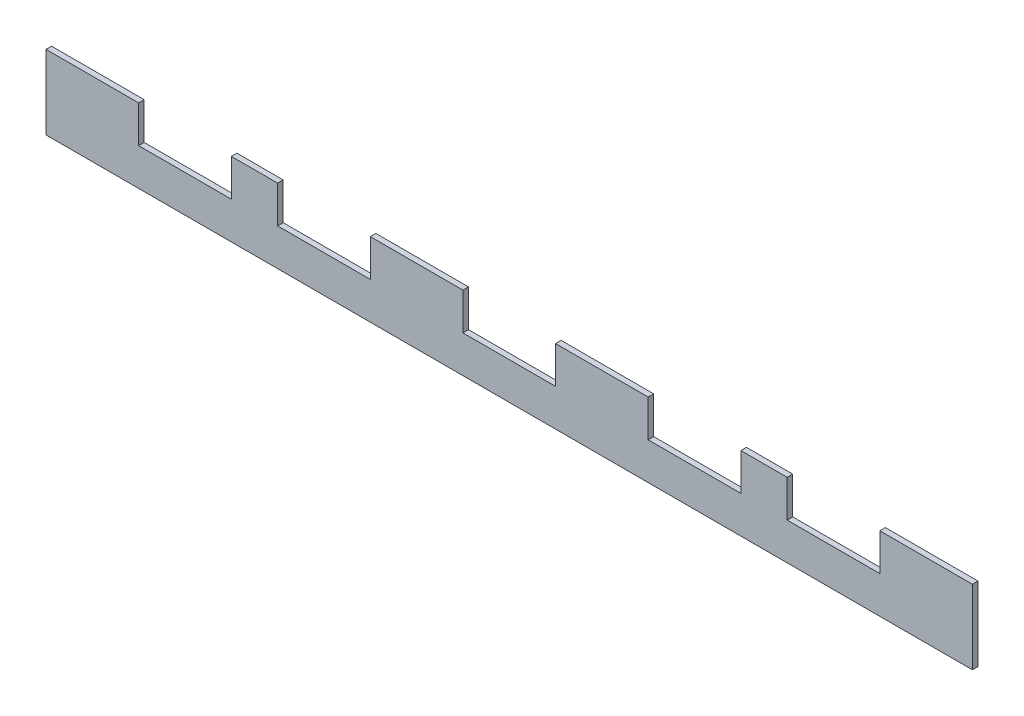
ISO-10303-21;
HEADER;
FILE_DESCRIPTION(('STEP AP214'),'2;1');
FILE_NAME('part.step','',(''),(''),'','','');
FILE_SCHEMA(('AUTOMOTIVE_DESIGN { 1 0 10303 214 1 1 1 1 }'));
ENDSEC;
DATA;
#1=APPLICATION_CONTEXT('core data for automotive mechanical design processes');
#2=APPLICATION_PROTOCOL_DEFINITION('international standard','automotive_design',2000,#1);
#3=PRODUCT_CONTEXT('',#1,'mechanical');
#4=PRODUCT('Part','Part','',(#3));
#5=PRODUCT_RELATED_PRODUCT_CATEGORY('part','',(#4));
#6=PRODUCT_DEFINITION_FORMATION('','',#4);
#7=PRODUCT_DEFINITION_CONTEXT('part definition',#1,'design');
#8=PRODUCT_DEFINITION('design','',#6,#7);
#9=PRODUCT_DEFINITION_SHAPE('','',#8);
#10=(LENGTH_UNIT() NAMED_UNIT(*) SI_UNIT(.MILLI.,.METRE.));
#11=(NAMED_UNIT(*) PLANE_ANGLE_UNIT() SI_UNIT($,.RADIAN.));
#12=(NAMED_UNIT(*) SI_UNIT($,.STERADIAN.) SOLID_ANGLE_UNIT());
#13=UNCERTAINTY_MEASURE_WITH_UNIT(LENGTH_MEASURE(1.E-05),#10,'distance_accuracy_value','');
#14=(GEOMETRIC_REPRESENTATION_CONTEXT(3) GLOBAL_UNCERTAINTY_ASSIGNED_CONTEXT((#13)) GLOBAL_UNIT_ASSIGNED_CONTEXT((#10,
#11,#12)) REPRESENTATION_CONTEXT('',''));
#15=CARTESIAN_POINT('',(0.,0.,0.));
#16=DIRECTION('',(0.,0.,1.));
#17=DIRECTION('',(1.,0.,0.));
#18=AXIS2_PLACEMENT_3D('',#15,#16,#17);
#19=CARTESIAN_POINT('',(0.,40.,3.));
#20=DIRECTION('',(0.,-1.,0.));
#21=DIRECTION('',(0.,0.,-1.));
#22=AXIS2_PLACEMENT_3D('',#19,#20,#21);
#23=PLANE('',#22);
#24=DIRECTION('',(-1.,0.,0.));
#25=VECTOR('',#24,1.);
#26=CARTESIAN_POINT('',(0.,40.,3.));
#27=LINE('',#26,#25);
#28=CARTESIAN_POINT('',(50.,40.,3.));
#29=VERTEX_POINT('',#28);
#30=CARTESIAN_POINT('',(0.,40.,3.));
#31=VERTEX_POINT('',#30);
#32=EDGE_CURVE('E346',#29,#31,#27,.T.);
#33=ORIENTED_EDGE('',*,*,#32,.F.);
#34=DIRECTION('',(0.,0.,1.));
#35=VECTOR('',#34,1.);
#36=CARTESIAN_POINT('',(50.,40.,0.));
#37=LINE('',#36,#35);
#38=CARTESIAN_POINT('',(50.,40.,0.));
#39=VERTEX_POINT('',#38);
#40=EDGE_CURVE('E230',#39,#29,#37,.T.);
#41=ORIENTED_EDGE('',*,*,#40,.F.);
#42=DIRECTION('',(-1.,0.,0.));
#43=VECTOR('',#42,1.);
#44=CARTESIAN_POINT('',(0.,40.,0.));
#45=LINE('',#44,#43);
#46=CARTESIAN_POINT('',(0.,40.,0.));
#47=VERTEX_POINT('',#46);
#48=EDGE_CURVE('E220',#39,#47,#45,.T.);
#49=ORIENTED_EDGE('',*,*,#48,.T.);
#50=DIRECTION('',(0.,0.,-1.));
#51=VECTOR('',#50,1.);
#52=CARTESIAN_POINT('',(0.,40.,3.));
#53=LINE('',#52,#51);
#54=EDGE_CURVE('E350',#31,#47,#53,.T.);
#55=ORIENTED_EDGE('',*,*,#54,.F.);
#56=EDGE_LOOP('',(#33,#41,#49,#55));
#57=FACE_BOUND('',#56,.T.);
#58=ADVANCED_FACE('F39',(#57),#23,.F.);
#59=CARTESIAN_POINT('',(400.,40.,3.));
#60=VERTEX_POINT('',#59);
#61=CARTESIAN_POINT('',(375.,40.,3.));
#62=VERTEX_POINT('',#61);
#63=EDGE_CURVE('E351',#60,#62,#27,.T.);
#64=ORIENTED_EDGE('',*,*,#63,.F.);
#65=DIRECTION('',(0.,0.,1.));
#66=VECTOR('',#65,1.);
#67=CARTESIAN_POINT('',(400.,40.,0.));
#68=LINE('',#67,#66);
#69=CARTESIAN_POINT('',(400.,40.,0.));
#70=VERTEX_POINT('',#69);
#71=EDGE_CURVE('E252',#70,#60,#68,.T.);
#72=ORIENTED_EDGE('',*,*,#71,.F.);
#73=CARTESIAN_POINT('',(375.,40.,0.));
#74=VERTEX_POINT('',#73);
#75=EDGE_CURVE('E360',#70,#74,#45,.T.);
#76=ORIENTED_EDGE('',*,*,#75,.T.);
#77=DIRECTION('',(0.,0.,1.));
#78=VECTOR('',#77,1.);
#79=CARTESIAN_POINT('',(375.,40.,0.));
#80=LINE('',#79,#78);
#81=EDGE_CURVE('E308',#74,#62,#80,.T.);
#82=ORIENTED_EDGE('',*,*,#81,.T.);
#83=EDGE_LOOP('',(#64,#72,#76,#82));
#84=FACE_BOUND('',#83,.T.);
#85=ADVANCED_FACE('F408',(#84),#23,.F.);
#86=CARTESIAN_POINT('',(225.,40.,3.));
#87=VERTEX_POINT('',#86);
#88=CARTESIAN_POINT('',(175.,40.,3.));
#89=VERTEX_POINT('',#88);
#90=EDGE_CURVE('E422',#87,#89,#27,.T.);
#91=ORIENTED_EDGE('',*,*,#90,.F.);
#92=DIRECTION('',(0.,0.,1.));
#93=VECTOR('',#92,1.);
#94=CARTESIAN_POINT('',(225.,40.,0.));
#95=LINE('',#94,#93);
#96=CARTESIAN_POINT('',(225.,40.,0.));
#97=VERTEX_POINT('',#96);
#98=EDGE_CURVE('E256',#97,#87,#95,.T.);
#99=ORIENTED_EDGE('',*,*,#98,.F.);
#100=CARTESIAN_POINT('',(175.,40.,0.));
#101=VERTEX_POINT('',#100);
#102=EDGE_CURVE('E390',#97,#101,#45,.T.);
#103=ORIENTED_EDGE('',*,*,#102,.T.);
#104=DIRECTION('',(0.,0.,1.));
#105=VECTOR('',#104,1.);
#106=CARTESIAN_POINT('',(175.,40.,0.));
#107=LINE('',#106,#105);
#108=EDGE_CURVE('E332',#101,#89,#107,.T.);
#109=ORIENTED_EDGE('',*,*,#108,.T.);
#110=EDGE_LOOP('',(#91,#99,#103,#109));
#111=FACE_BOUND('',#110,.T.);
#112=ADVANCED_FACE('F448',(#111),#23,.F.);
#113=CARTESIAN_POINT('',(125.,40.,0.));
#114=VERTEX_POINT('',#113);
#115=CARTESIAN_POINT('',(100.,40.,0.));
#116=VERTEX_POINT('',#115);
#117=EDGE_CURVE('E388',#114,#116,#45,.T.);
#118=ORIENTED_EDGE('',*,*,#117,.T.);
#119=DIRECTION('',(0.,0.,1.));
#120=VECTOR('',#119,1.);
#121=CARTESIAN_POINT('',(100.,40.,0.));
#122=LINE('',#121,#120);
#123=CARTESIAN_POINT('',(100.,40.,3.));
#124=VERTEX_POINT('',#123);
#125=EDGE_CURVE('E233',#116,#124,#122,.T.);
#126=ORIENTED_EDGE('',*,*,#125,.T.);
#127=CARTESIAN_POINT('',(125.,40.,3.));
#128=VERTEX_POINT('',#127);
#129=EDGE_CURVE('E426',#128,#124,#27,.T.);
#130=ORIENTED_EDGE('',*,*,#129,.F.);
#131=DIRECTION('',(0.,0.,1.));
#132=VECTOR('',#131,1.);
#133=CARTESIAN_POINT('',(125.,40.,0.));
#134=LINE('',#133,#132);
#135=EDGE_CURVE('E303',#114,#128,#134,.T.);
#136=ORIENTED_EDGE('',*,*,#135,.F.);
#137=EDGE_LOOP('',(#118,#126,#130,#136));
#138=FACE_BOUND('',#137,.T.);
#139=ADVANCED_FACE('F435',(#138),#23,.F.);
#140=CARTESIAN_POINT('',(325.,40.,0.));
#141=VERTEX_POINT('',#140);
#142=CARTESIAN_POINT('',(275.,40.,0.));
#143=VERTEX_POINT('',#142);
#144=EDGE_CURVE('E395',#141,#143,#45,.T.);
#145=ORIENTED_EDGE('',*,*,#144,.T.);
#146=DIRECTION('',(0.,0.,1.));
#147=VECTOR('',#146,1.);
#148=CARTESIAN_POINT('',(275.,40.,0.));
#149=LINE('',#148,#147);
#150=CARTESIAN_POINT('',(275.,40.,3.));
#151=VERTEX_POINT('',#150);
#152=EDGE_CURVE('E259',#143,#151,#149,.T.);
#153=ORIENTED_EDGE('',*,*,#152,.T.);
#154=CARTESIAN_POINT('',(325.,40.,3.));
#155=VERTEX_POINT('',#154);
#156=EDGE_CURVE('E420',#155,#151,#27,.T.);
#157=ORIENTED_EDGE('',*,*,#156,.F.);
#158=DIRECTION('',(0.,0.,1.));
#159=VECTOR('',#158,1.);
#160=CARTESIAN_POINT('',(325.,40.,0.));
#161=LINE('',#160,#159);
#162=EDGE_CURVE('E228',#141,#155,#161,.T.);
#163=ORIENTED_EDGE('',*,*,#162,.F.);
#164=EDGE_LOOP('',(#145,#153,#157,#163));
#165=FACE_BOUND('',#164,.T.);
#166=ADVANCED_FACE('F455',(#165),#23,.F.);
#167=CARTESIAN_POINT('',(0.,0.,3.));
#168=DIRECTION('',(1.,0.,0.));
#169=DIRECTION('',(0.,0.,-1.));
#170=AXIS2_PLACEMENT_3D('',#167,#168,#169);
#171=PLANE('',#170);
#172=DIRECTION('',(0.,-1.,0.));
#173=VECTOR('',#172,1.);
#174=CARTESIAN_POINT('',(0.,0.,0.));
#175=LINE('',#174,#173);
#176=CARTESIAN_POINT('',(0.,0.,0.));
#177=VERTEX_POINT('',#176);
#178=EDGE_CURVE('E232',#47,#177,#175,.T.);
#179=ORIENTED_EDGE('',*,*,#178,.T.);
#180=DIRECTION('',(0.,0.,-1.));
#181=VECTOR('',#180,1.);
#182=CARTESIAN_POINT('',(0.,0.,3.));
#183=LINE('',#182,#181);
#184=CARTESIAN_POINT('',(0.,0.,3.));
#185=VERTEX_POINT('',#184);
#186=EDGE_CURVE('E11',#185,#177,#183,.T.);
#187=ORIENTED_EDGE('',*,*,#186,.F.);
#188=DIRECTION('',(0.,-1.,0.));
#189=VECTOR('',#188,1.);
#190=CARTESIAN_POINT('',(0.,0.,3.));
#191=LINE('',#190,#189);
#192=EDGE_CURVE('E338',#31,#185,#191,.T.);
#193=ORIENTED_EDGE('',*,*,#192,.F.);
#194=ORIENTED_EDGE('',*,*,#54,.T.);
#195=EDGE_LOOP('',(#179,#187,#193,#194));
#196=FACE_BOUND('',#195,.T.);
#197=ADVANCED_FACE('F41',(#196),#171,.F.);
#198=CARTESIAN_POINT('',(0.,0.,3.));
#199=DIRECTION('',(0.,1.,0.));
#200=DIRECTION('',(0.,0.,1.));
#201=AXIS2_PLACEMENT_3D('',#198,#199,#200);
#202=PLANE('',#201);
#203=DIRECTION('',(1.,0.,0.));
#204=VECTOR('',#203,1.);
#205=CARTESIAN_POINT('',(0.,0.,0.));
#206=LINE('',#205,#204);
#207=CARTESIAN_POINT('',(500.,0.,0.));
#208=VERTEX_POINT('',#207);
#209=EDGE_CURVE('E354',#177,#208,#206,.T.);
#210=ORIENTED_EDGE('',*,*,#209,.T.);
#211=DIRECTION('',(0.,0.,-1.));
#212=VECTOR('',#211,1.);
#213=CARTESIAN_POINT('',(500.,0.,3.));
#214=LINE('',#213,#212);
#215=CARTESIAN_POINT('',(500.,0.,3.));
#216=VERTEX_POINT('',#215);
#217=EDGE_CURVE('E47',#216,#208,#214,.T.);
#218=ORIENTED_EDGE('',*,*,#217,.F.);
#219=DIRECTION('',(1.,0.,0.));
#220=VECTOR('',#219,1.);
#221=CARTESIAN_POINT('',(0.,0.,3.));
#222=LINE('',#221,#220);
#223=EDGE_CURVE('E341',#185,#216,#222,.T.);
#224=ORIENTED_EDGE('',*,*,#223,.F.);
#225=ORIENTED_EDGE('',*,*,#186,.T.);
#226=EDGE_LOOP('',(#210,#218,#224,#225));
#227=FACE_BOUND('',#226,.T.);
#228=ADVANCED_FACE('F383',(#227),#202,.F.);
#229=CARTESIAN_POINT('',(500.,0.,3.));
#230=DIRECTION('',(-1.,0.,0.));
#231=DIRECTION('',(0.,0.,1.));
#232=AXIS2_PLACEMENT_3D('',#229,#230,#231);
#233=PLANE('',#232);
#234=DIRECTION('',(0.,1.,0.));
#235=VECTOR('',#234,1.);
#236=CARTESIAN_POINT('',(500.,0.,0.));
#237=LINE('',#236,#235);
#238=CARTESIAN_POINT('',(500.,40.,0.));
#239=VERTEX_POINT('',#238);
#240=EDGE_CURVE('E356',#208,#239,#237,.T.);
#241=ORIENTED_EDGE('',*,*,#240,.T.);
#242=DIRECTION('',(0.,0.,-1.));
#243=VECTOR('',#242,1.);
#244=CARTESIAN_POINT('',(500.,40.,3.));
#245=LINE('',#244,#243);
#246=CARTESIAN_POINT('',(500.,40.,3.));
#247=VERTEX_POINT('',#246);
#248=EDGE_CURVE('E363',#247,#239,#245,.T.);
#249=ORIENTED_EDGE('',*,*,#248,.F.);
#250=DIRECTION('',(0.,1.,0.));
#251=VECTOR('',#250,1.);
#252=CARTESIAN_POINT('',(500.,0.,3.));
#253=LINE('',#252,#251);
#254=EDGE_CURVE('E344',#216,#247,#253,.T.);
#255=ORIENTED_EDGE('',*,*,#254,.F.);
#256=ORIENTED_EDGE('',*,*,#217,.T.);
#257=EDGE_LOOP('',(#241,#249,#255,#256));
#258=FACE_BOUND('',#257,.T.);
#259=ADVANCED_FACE('F370',(#258),#233,.F.);
#260=CARTESIAN_POINT('',(450.,40.,0.));
#261=VERTEX_POINT('',#260);
#262=EDGE_CURVE('E342',#239,#261,#45,.T.);
#263=ORIENTED_EDGE('',*,*,#262,.T.);
#264=DIRECTION('',(0.,0.,1.));
#265=VECTOR('',#264,1.);
#266=CARTESIAN_POINT('',(450.,40.,0.));
#267=LINE('',#266,#265);
#268=CARTESIAN_POINT('',(450.,40.,3.));
#269=VERTEX_POINT('',#268);
#270=EDGE_CURVE('E282',#261,#269,#267,.T.);
#271=ORIENTED_EDGE('',*,*,#270,.T.);
#272=EDGE_CURVE('E347',#247,#269,#27,.T.);
#273=ORIENTED_EDGE('',*,*,#272,.F.);
#274=ORIENTED_EDGE('',*,*,#248,.T.);
#275=EDGE_LOOP('',(#263,#271,#273,#274));
#276=FACE_BOUND('',#275,.T.);
#277=ADVANCED_FACE('F375',(#276),#23,.F.);
#278=CARTESIAN_POINT('',(0.,0.,3.));
#279=DIRECTION('',(0.,0.,-1.));
#280=DIRECTION('',(-1.,0.,0.));
#281=AXIS2_PLACEMENT_3D('',#278,#279,#280);
#282=PLANE('',#281);
#283=DIRECTION('',(1.,0.,0.));
#284=VECTOR('',#283,1.);
#285=CARTESIAN_POINT('',(50.,20.,3.));
#286=LINE('',#285,#284);
#287=CARTESIAN_POINT('',(50.,20.,3.));
#288=VERTEX_POINT('',#287);
#289=CARTESIAN_POINT('',(100.,20.,3.));
#290=VERTEX_POINT('',#289);
#291=EDGE_CURVE('E223',#288,#290,#286,.T.);
#292=ORIENTED_EDGE('',*,*,#291,.F.);
#293=DIRECTION('',(0.,-1.,0.));
#294=VECTOR('',#293,1.);
#295=CARTESIAN_POINT('',(50.,40.,3.));
#296=LINE('',#295,#294);
#297=EDGE_CURVE('E206',#29,#288,#296,.T.);
#298=ORIENTED_EDGE('',*,*,#297,.F.);
#299=ORIENTED_EDGE('',*,*,#32,.T.);
#300=ORIENTED_EDGE('',*,*,#192,.T.);
#301=ORIENTED_EDGE('',*,*,#223,.T.);
#302=ORIENTED_EDGE('',*,*,#254,.T.);
#303=ORIENTED_EDGE('',*,*,#272,.T.);
#304=DIRECTION('',(0.,1.,0.));
#305=VECTOR('',#304,1.);
#306=CARTESIAN_POINT('',(450.,40.,3.));
#307=LINE('',#306,#305);
#308=CARTESIAN_POINT('',(450.,20.,3.));
#309=VERTEX_POINT('',#308);
#310=EDGE_CURVE('E269',#309,#269,#307,.T.);
#311=ORIENTED_EDGE('',*,*,#310,.F.);
#312=DIRECTION('',(1.,0.,0.));
#313=VECTOR('',#312,1.);
#314=CARTESIAN_POINT('',(400.,20.,3.));
#315=LINE('',#314,#313);
#316=CARTESIAN_POINT('',(400.,20.,3.));
#317=VERTEX_POINT('',#316);
#318=EDGE_CURVE('E277',#317,#309,#315,.T.);
#319=ORIENTED_EDGE('',*,*,#318,.F.);
#320=DIRECTION('',(0.,-1.,0.));
#321=VECTOR('',#320,1.);
#322=CARTESIAN_POINT('',(400.,40.,3.));
#323=LINE('',#322,#321);
#324=EDGE_CURVE('E274',#60,#317,#323,.T.);
#325=ORIENTED_EDGE('',*,*,#324,.F.);
#326=ORIENTED_EDGE('',*,*,#63,.T.);
#327=DIRECTION('',(0.,1.,0.));
#328=VECTOR('',#327,1.);
#329=CARTESIAN_POINT('',(375.,40.,3.));
#330=LINE('',#329,#328);
#331=CARTESIAN_POINT('',(375.,20.,3.));
#332=VERTEX_POINT('',#331);
#333=EDGE_CURVE('E292',#332,#62,#330,.T.);
#334=ORIENTED_EDGE('',*,*,#333,.F.);
#335=DIRECTION('',(1.,0.,0.));
#336=VECTOR('',#335,1.);
#337=CARTESIAN_POINT('',(325.,20.,3.));
#338=LINE('',#337,#336);
#339=CARTESIAN_POINT('',(325.,20.,3.));
#340=VERTEX_POINT('',#339);
#341=EDGE_CURVE('E302',#340,#332,#338,.T.);
#342=ORIENTED_EDGE('',*,*,#341,.F.);
#343=DIRECTION('',(0.,-1.,0.));
#344=VECTOR('',#343,1.);
#345=CARTESIAN_POINT('',(325.,40.,3.));
#346=LINE('',#345,#344);
#347=EDGE_CURVE('E299',#155,#340,#346,.T.);
#348=ORIENTED_EDGE('',*,*,#347,.F.);
#349=ORIENTED_EDGE('',*,*,#156,.T.);
#350=DIRECTION('',(0.,1.,0.));
#351=VECTOR('',#350,1.);
#352=CARTESIAN_POINT('',(275.,40.,3.));
#353=LINE('',#352,#351);
#354=CARTESIAN_POINT('',(275.,20.,3.));
#355=VERTEX_POINT('',#354);
#356=EDGE_CURVE('E241',#355,#151,#353,.T.);
#357=ORIENTED_EDGE('',*,*,#356,.F.);
#358=DIRECTION('',(1.,0.,0.));
#359=VECTOR('',#358,1.);
#360=CARTESIAN_POINT('',(225.,20.,3.));
#361=LINE('',#360,#359);
#362=CARTESIAN_POINT('',(225.,20.,3.));
#363=VERTEX_POINT('',#362);
#364=EDGE_CURVE('E251',#363,#355,#361,.T.);
#365=ORIENTED_EDGE('',*,*,#364,.F.);
#366=DIRECTION('',(0.,-1.,0.));
#367=VECTOR('',#366,1.);
#368=CARTESIAN_POINT('',(225.,40.,3.));
#369=LINE('',#368,#367);
#370=EDGE_CURVE('E248',#87,#363,#369,.T.);
#371=ORIENTED_EDGE('',*,*,#370,.F.);
#372=ORIENTED_EDGE('',*,*,#90,.T.);
#373=DIRECTION('',(0.,1.,0.));
#374=VECTOR('',#373,1.);
#375=CARTESIAN_POINT('',(175.,40.,3.));
#376=LINE('',#375,#374);
#377=CARTESIAN_POINT('',(175.,20.,3.));
#378=VERTEX_POINT('',#377);
#379=EDGE_CURVE('E318',#378,#89,#376,.T.);
#380=ORIENTED_EDGE('',*,*,#379,.F.);
#381=DIRECTION('',(1.,0.,0.));
#382=VECTOR('',#381,1.);
#383=CARTESIAN_POINT('',(125.,20.,3.));
#384=LINE('',#383,#382);
#385=CARTESIAN_POINT('',(125.,20.,3.));
#386=VERTEX_POINT('',#385);
#387=EDGE_CURVE('E327',#386,#378,#384,.T.);
#388=ORIENTED_EDGE('',*,*,#387,.F.);
#389=DIRECTION('',(0.,-1.,0.));
#390=VECTOR('',#389,1.);
#391=CARTESIAN_POINT('',(125.,40.,3.));
#392=LINE('',#391,#390);
#393=EDGE_CURVE('E258',#128,#386,#392,.T.);
#394=ORIENTED_EDGE('',*,*,#393,.F.);
#395=ORIENTED_EDGE('',*,*,#129,.T.);
#396=DIRECTION('',(0.,1.,0.));
#397=VECTOR('',#396,1.);
#398=CARTESIAN_POINT('',(100.,40.,3.));
#399=LINE('',#398,#397);
#400=EDGE_CURVE('E221',#290,#124,#399,.T.);
#401=ORIENTED_EDGE('',*,*,#400,.F.);
#402=EDGE_LOOP('',(#292,#298,#299,#300,#301,#302,#303,#311,#319,#325,#326,#334,#342,#348,#349,
#357,#365,#371,#372,#380,#388,#394,#395,#401));
#403=FACE_BOUND('',#402,.T.);
#404=ADVANCED_FACE('F379',(#403),#282,.F.);
#405=CARTESIAN_POINT('',(0.,0.,0.));
#406=DIRECTION('',(0.,0.,-1.));
#407=DIRECTION('',(-1.,0.,0.));
#408=AXIS2_PLACEMENT_3D('',#405,#406,#407);
#409=PLANE('',#408);
#410=DIRECTION('',(0.,-1.,0.));
#411=VECTOR('',#410,1.);
#412=CARTESIAN_POINT('',(50.,40.,0.));
#413=LINE('',#412,#411);
#414=CARTESIAN_POINT('',(50.,20.,0.));
#415=VERTEX_POINT('',#414);
#416=EDGE_CURVE('E203',#39,#415,#413,.T.);
#417=ORIENTED_EDGE('',*,*,#416,.T.);
#418=DIRECTION('',(1.,0.,0.));
#419=VECTOR('',#418,1.);
#420=CARTESIAN_POINT('',(50.,20.,0.));
#421=LINE('',#420,#419);
#422=CARTESIAN_POINT('',(100.,20.,0.));
#423=VERTEX_POINT('',#422);
#424=EDGE_CURVE('E213',#415,#423,#421,.T.);
#425=ORIENTED_EDGE('',*,*,#424,.T.);
#426=DIRECTION('',(0.,1.,0.));
#427=VECTOR('',#426,1.);
#428=CARTESIAN_POINT('',(100.,40.,0.));
#429=LINE('',#428,#427);
#430=EDGE_CURVE('E54',#423,#116,#429,.T.);
#431=ORIENTED_EDGE('',*,*,#430,.T.);
#432=ORIENTED_EDGE('',*,*,#117,.F.);
#433=DIRECTION('',(0.,-1.,0.));
#434=VECTOR('',#433,1.);
#435=CARTESIAN_POINT('',(125.,40.,0.));
#436=LINE('',#435,#434);
#437=CARTESIAN_POINT('',(125.,20.,0.));
#438=VERTEX_POINT('',#437);
#439=EDGE_CURVE('E314',#114,#438,#436,.T.);
#440=ORIENTED_EDGE('',*,*,#439,.T.);
#441=DIRECTION('',(1.,0.,0.));
#442=VECTOR('',#441,1.);
#443=CARTESIAN_POINT('',(125.,20.,0.));
#444=LINE('',#443,#442);
#445=CARTESIAN_POINT('',(175.,20.,0.));
#446=VERTEX_POINT('',#445);
#447=EDGE_CURVE('E317',#438,#446,#444,.T.);
#448=ORIENTED_EDGE('',*,*,#447,.T.);
#449=DIRECTION('',(0.,1.,0.));
#450=VECTOR('',#449,1.);
#451=CARTESIAN_POINT('',(175.,40.,0.));
#452=LINE('',#451,#450);
#453=EDGE_CURVE('E321',#446,#101,#452,.T.);
#454=ORIENTED_EDGE('',*,*,#453,.T.);
#455=ORIENTED_EDGE('',*,*,#102,.F.);
#456=DIRECTION('',(0.,-1.,0.));
#457=VECTOR('',#456,1.);
#458=CARTESIAN_POINT('',(225.,40.,0.));
#459=LINE('',#458,#457);
#460=CARTESIAN_POINT('',(225.,20.,0.));
#461=VERTEX_POINT('',#460);
#462=EDGE_CURVE('E237',#97,#461,#459,.T.);
#463=ORIENTED_EDGE('',*,*,#462,.T.);
#464=DIRECTION('',(1.,0.,0.));
#465=VECTOR('',#464,1.);
#466=CARTESIAN_POINT('',(225.,20.,0.));
#467=LINE('',#466,#465);
#468=CARTESIAN_POINT('',(275.,20.,0.));
#469=VERTEX_POINT('',#468);
#470=EDGE_CURVE('E240',#461,#469,#467,.T.);
#471=ORIENTED_EDGE('',*,*,#470,.T.);
#472=DIRECTION('',(0.,1.,0.));
#473=VECTOR('',#472,1.);
#474=CARTESIAN_POINT('',(275.,40.,0.));
#475=LINE('',#474,#473);
#476=EDGE_CURVE('E244',#469,#143,#475,.T.);
#477=ORIENTED_EDGE('',*,*,#476,.T.);
#478=ORIENTED_EDGE('',*,*,#144,.F.);
#479=DIRECTION('',(0.,-1.,0.));
#480=VECTOR('',#479,1.);
#481=CARTESIAN_POINT('',(325.,40.,0.));
#482=LINE('',#481,#480);
#483=CARTESIAN_POINT('',(325.,20.,0.));
#484=VERTEX_POINT('',#483);
#485=EDGE_CURVE('E288',#141,#484,#482,.T.);
#486=ORIENTED_EDGE('',*,*,#485,.T.);
#487=DIRECTION('',(1.,0.,0.));
#488=VECTOR('',#487,1.);
#489=CARTESIAN_POINT('',(325.,20.,0.));
#490=LINE('',#489,#488);
#491=CARTESIAN_POINT('',(375.,20.,0.));
#492=VERTEX_POINT('',#491);
#493=EDGE_CURVE('E291',#484,#492,#490,.T.);
#494=ORIENTED_EDGE('',*,*,#493,.T.);
#495=DIRECTION('',(0.,1.,0.));
#496=VECTOR('',#495,1.);
#497=CARTESIAN_POINT('',(375.,40.,0.));
#498=LINE('',#497,#496);
#499=EDGE_CURVE('E295',#492,#74,#498,.T.);
#500=ORIENTED_EDGE('',*,*,#499,.T.);
#501=ORIENTED_EDGE('',*,*,#75,.F.);
#502=DIRECTION('',(0.,-1.,0.));
#503=VECTOR('',#502,1.);
#504=CARTESIAN_POINT('',(400.,40.,0.));
#505=LINE('',#504,#503);
#506=CARTESIAN_POINT('',(400.,20.,0.));
#507=VERTEX_POINT('',#506);
#508=EDGE_CURVE('E265',#70,#507,#505,.T.);
#509=ORIENTED_EDGE('',*,*,#508,.T.);
#510=DIRECTION('',(1.,0.,0.));
#511=VECTOR('',#510,1.);
#512=CARTESIAN_POINT('',(400.,20.,0.));
#513=LINE('',#512,#511);
#514=CARTESIAN_POINT('',(450.,20.,0.));
#515=VERTEX_POINT('',#514);
#516=EDGE_CURVE('E268',#507,#515,#513,.T.);
#517=ORIENTED_EDGE('',*,*,#516,.T.);
#518=DIRECTION('',(0.,1.,0.));
#519=VECTOR('',#518,1.);
#520=CARTESIAN_POINT('',(450.,40.,0.));
#521=LINE('',#520,#519);
#522=EDGE_CURVE('E62',#515,#261,#521,.T.);
#523=ORIENTED_EDGE('',*,*,#522,.T.);
#524=ORIENTED_EDGE('',*,*,#262,.F.);
#525=ORIENTED_EDGE('',*,*,#240,.F.);
#526=ORIENTED_EDGE('',*,*,#209,.F.);
#527=ORIENTED_EDGE('',*,*,#178,.F.);
#528=ORIENTED_EDGE('',*,*,#48,.F.);
#529=EDGE_LOOP('',(#417,#425,#431,#432,#440,#448,#454,#455,#463,#471,#477,#478,#486,#494,#500,
#501,#509,#517,#523,#524,#525,#526,#527,#528));
#530=FACE_BOUND('',#529,.T.);
#531=ADVANCED_FACE('F218',(#530),#409,.T.);
#532=CARTESIAN_POINT('',(325.,40.,0.));
#533=DIRECTION('',(-1.,0.,0.));
#534=DIRECTION('',(0.,0.,1.));
#535=AXIS2_PLACEMENT_3D('',#532,#533,#534);
#536=PLANE('',#535);
#537=ORIENTED_EDGE('',*,*,#347,.T.);
#538=DIRECTION('',(0.,0.,1.));
#539=VECTOR('',#538,1.);
#540=CARTESIAN_POINT('',(325.,20.,0.));
#541=LINE('',#540,#539);
#542=EDGE_CURVE('E298',#484,#340,#541,.T.);
#543=ORIENTED_EDGE('',*,*,#542,.F.);
#544=ORIENTED_EDGE('',*,*,#485,.F.);
#545=ORIENTED_EDGE('',*,*,#162,.T.);
#546=EDGE_LOOP('',(#537,#543,#544,#545));
#547=FACE_BOUND('',#546,.T.);
#548=ADVANCED_FACE('F492',(#547),#536,.F.);
#549=CARTESIAN_POINT('',(375.,40.,0.));
#550=DIRECTION('',(1.,0.,0.));
#551=DIRECTION('',(0.,0.,-1.));
#552=AXIS2_PLACEMENT_3D('',#549,#550,#551);
#553=PLANE('',#552);
#554=ORIENTED_EDGE('',*,*,#333,.T.);
#555=ORIENTED_EDGE('',*,*,#81,.F.);
#556=ORIENTED_EDGE('',*,*,#499,.F.);
#557=DIRECTION('',(0.,0.,1.));
#558=VECTOR('',#557,1.);
#559=CARTESIAN_POINT('',(375.,20.,0.));
#560=LINE('',#559,#558);
#561=EDGE_CURVE('E311',#492,#332,#560,.T.);
#562=ORIENTED_EDGE('',*,*,#561,.T.);
#563=EDGE_LOOP('',(#554,#555,#556,#562));
#564=FACE_BOUND('',#563,.T.);
#565=ADVANCED_FACE('F413',(#564),#553,.F.);
#566=CARTESIAN_POINT('',(325.,20.,0.));
#567=DIRECTION('',(0.,-1.,0.));
#568=DIRECTION('',(0.,0.,-1.));
#569=AXIS2_PLACEMENT_3D('',#566,#567,#568);
#570=PLANE('',#569);
#571=ORIENTED_EDGE('',*,*,#341,.T.);
#572=ORIENTED_EDGE('',*,*,#561,.F.);
#573=ORIENTED_EDGE('',*,*,#493,.F.);
#574=ORIENTED_EDGE('',*,*,#542,.T.);
#575=EDGE_LOOP('',(#571,#572,#573,#574));
#576=FACE_BOUND('',#575,.T.);
#577=ADVANCED_FACE('F415',(#576),#570,.F.);
#578=CARTESIAN_POINT('',(125.,40.,0.));
#579=DIRECTION('',(-1.,0.,0.));
#580=DIRECTION('',(0.,0.,1.));
#581=AXIS2_PLACEMENT_3D('',#578,#579,#580);
#582=PLANE('',#581);
#583=ORIENTED_EDGE('',*,*,#393,.T.);
#584=DIRECTION('',(0.,0.,1.));
#585=VECTOR('',#584,1.);
#586=CARTESIAN_POINT('',(125.,20.,0.));
#587=LINE('',#586,#585);
#588=EDGE_CURVE('E324',#438,#386,#587,.T.);
#589=ORIENTED_EDGE('',*,*,#588,.F.);
#590=ORIENTED_EDGE('',*,*,#439,.F.);
#591=ORIENTED_EDGE('',*,*,#135,.T.);
#592=EDGE_LOOP('',(#583,#589,#590,#591));
#593=FACE_BOUND('',#592,.T.);
#594=ADVANCED_FACE('F438',(#593),#582,.F.);
#595=CARTESIAN_POINT('',(175.,40.,0.));
#596=DIRECTION('',(1.,0.,0.));
#597=DIRECTION('',(0.,0.,-1.));
#598=AXIS2_PLACEMENT_3D('',#595,#596,#597);
#599=PLANE('',#598);
#600=ORIENTED_EDGE('',*,*,#379,.T.);
#601=ORIENTED_EDGE('',*,*,#108,.F.);
#602=ORIENTED_EDGE('',*,*,#453,.F.);
#603=DIRECTION('',(0.,0.,1.));
#604=VECTOR('',#603,1.);
#605=CARTESIAN_POINT('',(175.,20.,0.));
#606=LINE('',#605,#604);
#607=EDGE_CURVE('E335',#446,#378,#606,.T.);
#608=ORIENTED_EDGE('',*,*,#607,.T.);
#609=EDGE_LOOP('',(#600,#601,#602,#608));
#610=FACE_BOUND('',#609,.T.);
#611=ADVANCED_FACE('F444',(#610),#599,.F.);
#612=CARTESIAN_POINT('',(125.,20.,0.));
#613=DIRECTION('',(0.,-1.,0.));
#614=DIRECTION('',(0.,0.,-1.));
#615=AXIS2_PLACEMENT_3D('',#612,#613,#614);
#616=PLANE('',#615);
#617=ORIENTED_EDGE('',*,*,#387,.T.);
#618=ORIENTED_EDGE('',*,*,#607,.F.);
#619=ORIENTED_EDGE('',*,*,#447,.F.);
#620=ORIENTED_EDGE('',*,*,#588,.T.);
#621=EDGE_LOOP('',(#617,#618,#619,#620));
#622=FACE_BOUND('',#621,.T.);
#623=ADVANCED_FACE('F442',(#622),#616,.F.);
#624=CARTESIAN_POINT('',(225.,40.,0.));
#625=DIRECTION('',(-1.,0.,0.));
#626=DIRECTION('',(0.,0.,1.));
#627=AXIS2_PLACEMENT_3D('',#624,#625,#626);
#628=PLANE('',#627);
#629=ORIENTED_EDGE('',*,*,#370,.T.);
#630=DIRECTION('',(0.,0.,1.));
#631=VECTOR('',#630,1.);
#632=CARTESIAN_POINT('',(225.,20.,0.));
#633=LINE('',#632,#631);
#634=EDGE_CURVE('E247',#461,#363,#633,.T.);
#635=ORIENTED_EDGE('',*,*,#634,.F.);
#636=ORIENTED_EDGE('',*,*,#462,.F.);
#637=ORIENTED_EDGE('',*,*,#98,.T.);
#638=EDGE_LOOP('',(#629,#635,#636,#637));
#639=FACE_BOUND('',#638,.T.);
#640=ADVANCED_FACE('F447',(#639),#628,.F.);
#641=CARTESIAN_POINT('',(275.,40.,0.));
#642=DIRECTION('',(1.,0.,0.));
#643=DIRECTION('',(0.,0.,-1.));
#644=AXIS2_PLACEMENT_3D('',#641,#642,#643);
#645=PLANE('',#644);
#646=ORIENTED_EDGE('',*,*,#356,.T.);
#647=ORIENTED_EDGE('',*,*,#152,.F.);
#648=ORIENTED_EDGE('',*,*,#476,.F.);
#649=DIRECTION('',(0.,0.,1.));
#650=VECTOR('',#649,1.);
#651=CARTESIAN_POINT('',(275.,20.,0.));
#652=LINE('',#651,#650);
#653=EDGE_CURVE('E262',#469,#355,#652,.T.);
#654=ORIENTED_EDGE('',*,*,#653,.T.);
#655=EDGE_LOOP('',(#646,#647,#648,#654));
#656=FACE_BOUND('',#655,.T.);
#657=ADVANCED_FACE('F550',(#656),#645,.F.);
#658=CARTESIAN_POINT('',(225.,20.,0.));
#659=DIRECTION('',(0.,-1.,0.));
#660=DIRECTION('',(0.,0.,-1.));
#661=AXIS2_PLACEMENT_3D('',#658,#659,#660);
#662=PLANE('',#661);
#663=ORIENTED_EDGE('',*,*,#364,.T.);
#664=ORIENTED_EDGE('',*,*,#653,.F.);
#665=ORIENTED_EDGE('',*,*,#470,.F.);
#666=ORIENTED_EDGE('',*,*,#634,.T.);
#667=EDGE_LOOP('',(#663,#664,#665,#666));
#668=FACE_BOUND('',#667,.T.);
#669=ADVANCED_FACE('F557',(#668),#662,.F.);
#670=CARTESIAN_POINT('',(400.,40.,0.));
#671=DIRECTION('',(-1.,0.,0.));
#672=DIRECTION('',(0.,0.,1.));
#673=AXIS2_PLACEMENT_3D('',#670,#671,#672);
#674=PLANE('',#673);
#675=ORIENTED_EDGE('',*,*,#324,.T.);
#676=DIRECTION('',(0.,0.,1.));
#677=VECTOR('',#676,1.);
#678=CARTESIAN_POINT('',(400.,20.,0.));
#679=LINE('',#678,#677);
#680=EDGE_CURVE('E273',#507,#317,#679,.T.);
#681=ORIENTED_EDGE('',*,*,#680,.F.);
#682=ORIENTED_EDGE('',*,*,#508,.F.);
#683=ORIENTED_EDGE('',*,*,#71,.T.);
#684=EDGE_LOOP('',(#675,#681,#682,#683));
#685=FACE_BOUND('',#684,.T.);
#686=ADVANCED_FACE('F565',(#685),#674,.F.);
#687=CARTESIAN_POINT('',(450.,40.,0.));
#688=DIRECTION('',(1.,0.,0.));
#689=DIRECTION('',(0.,0.,-1.));
#690=AXIS2_PLACEMENT_3D('',#687,#688,#689);
#691=PLANE('',#690);
#692=ORIENTED_EDGE('',*,*,#310,.T.);
#693=ORIENTED_EDGE('',*,*,#270,.F.);
#694=ORIENTED_EDGE('',*,*,#522,.F.);
#695=DIRECTION('',(0.,0.,1.));
#696=VECTOR('',#695,1.);
#697=CARTESIAN_POINT('',(450.,20.,0.));
#698=LINE('',#697,#696);
#699=EDGE_CURVE('E285',#515,#309,#698,.T.);
#700=ORIENTED_EDGE('',*,*,#699,.T.);
#701=EDGE_LOOP('',(#692,#693,#694,#700));
#702=FACE_BOUND('',#701,.T.);
#703=ADVANCED_FACE('F573',(#702),#691,.F.);
#704=CARTESIAN_POINT('',(400.,20.,0.));
#705=DIRECTION('',(0.,-1.,0.));
#706=DIRECTION('',(0.,0.,-1.));
#707=AXIS2_PLACEMENT_3D('',#704,#705,#706);
#708=PLANE('',#707);
#709=ORIENTED_EDGE('',*,*,#318,.T.);
#710=ORIENTED_EDGE('',*,*,#699,.F.);
#711=ORIENTED_EDGE('',*,*,#516,.F.);
#712=ORIENTED_EDGE('',*,*,#680,.T.);
#713=EDGE_LOOP('',(#709,#710,#711,#712));
#714=FACE_BOUND('',#713,.T.);
#715=ADVANCED_FACE('F581',(#714),#708,.F.);
#716=CARTESIAN_POINT('',(50.,40.,0.));
#717=DIRECTION('',(-1.,0.,0.));
#718=DIRECTION('',(0.,-1.,0.));
#719=AXIS2_PLACEMENT_3D('',#716,#717,#718);
#720=PLANE('',#719);
#721=ORIENTED_EDGE('',*,*,#297,.T.);
#722=DIRECTION('',(0.,0.,1.));
#723=VECTOR('',#722,1.);
#724=CARTESIAN_POINT('',(50.,20.,0.));
#725=LINE('',#724,#723);
#726=EDGE_CURVE('E199',#415,#288,#725,.T.);
#727=ORIENTED_EDGE('',*,*,#726,.F.);
#728=ORIENTED_EDGE('',*,*,#416,.F.);
#729=ORIENTED_EDGE('',*,*,#40,.T.);
#730=EDGE_LOOP('',(#721,#727,#728,#729));
#731=FACE_BOUND('',#730,.T.);
#732=ADVANCED_FACE('F201',(#731),#720,.F.);
#733=CARTESIAN_POINT('',(100.,40.,0.));
#734=DIRECTION('',(1.,0.,0.));
#735=DIRECTION('',(0.,0.,-1.));
#736=AXIS2_PLACEMENT_3D('',#733,#734,#735);
#737=PLANE('',#736);
#738=ORIENTED_EDGE('',*,*,#400,.T.);
#739=ORIENTED_EDGE('',*,*,#125,.F.);
#740=ORIENTED_EDGE('',*,*,#430,.F.);
#741=DIRECTION('',(0.,0.,1.));
#742=VECTOR('',#741,1.);
#743=CARTESIAN_POINT('',(100.,20.,0.));
#744=LINE('',#743,#742);
#745=EDGE_CURVE('E210',#423,#290,#744,.T.);
#746=ORIENTED_EDGE('',*,*,#745,.T.);
#747=EDGE_LOOP('',(#738,#739,#740,#746));
#748=FACE_BOUND('',#747,.T.);
#749=ADVANCED_FACE('F434',(#748),#737,.F.);
#750=CARTESIAN_POINT('',(50.,20.,0.));
#751=DIRECTION('',(0.,-1.,0.));
#752=DIRECTION('',(0.,0.,-1.));
#753=AXIS2_PLACEMENT_3D('',#750,#751,#752);
#754=PLANE('',#753);
#755=ORIENTED_EDGE('',*,*,#291,.T.);
#756=ORIENTED_EDGE('',*,*,#745,.F.);
#757=ORIENTED_EDGE('',*,*,#424,.F.);
#758=ORIENTED_EDGE('',*,*,#726,.T.);
#759=EDGE_LOOP('',(#755,#756,#757,#758));
#760=FACE_BOUND('',#759,.T.);
#761=ADVANCED_FACE('F214',(#760),#754,.F.);
#762=CLOSED_SHELL('',(#58,#85,#112,#139,#166,#197,#228,#259,#277,#404,#531,#548,#565,#577,#594,
#611,#623,#640,#657,#669,#686,#703,#715,#732,#749,#761));
#763=MANIFOLD_SOLID_BREP('B2',#762);
#764=ADVANCED_BREP_SHAPE_REPRESENTATION('',(#18,#763),#14);
#765=SHAPE_DEFINITION_REPRESENTATION(#9,#764);
ENDSEC;
END-ISO-10303-21;
